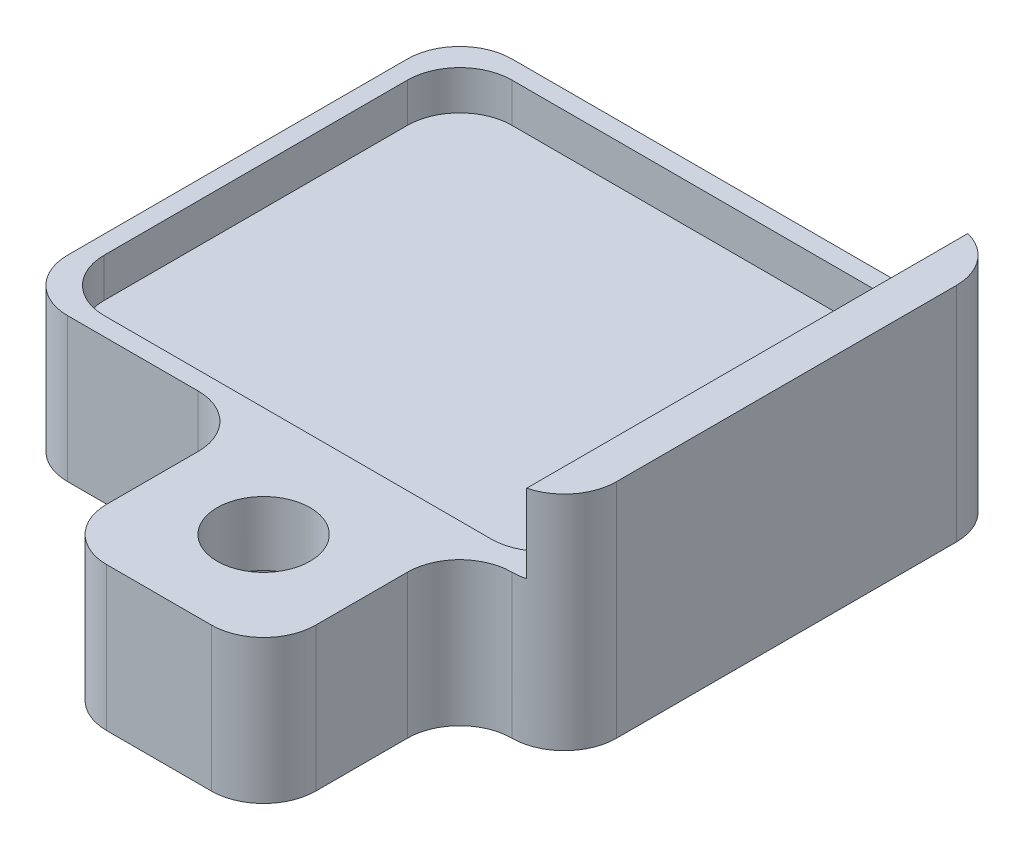
ISO-10303-21;
HEADER;
FILE_DESCRIPTION(('STEP AP214'),'2;1');
FILE_NAME('part.step','',(''),(''),'','','');
FILE_SCHEMA(('AUTOMOTIVE_DESIGN { 1 0 10303 214 1 1 1 1 }'));
ENDSEC;
DATA;
#1=APPLICATION_CONTEXT('core data for automotive mechanical design processes');
#2=APPLICATION_PROTOCOL_DEFINITION('international standard','automotive_design',2000,#1);
#3=PRODUCT_CONTEXT('',#1,'mechanical');
#4=PRODUCT('Part','Part','',(#3));
#5=PRODUCT_RELATED_PRODUCT_CATEGORY('part','',(#4));
#6=PRODUCT_DEFINITION_FORMATION('','',#4);
#7=PRODUCT_DEFINITION_CONTEXT('part definition',#1,'design');
#8=PRODUCT_DEFINITION('design','',#6,#7);
#9=PRODUCT_DEFINITION_SHAPE('','',#8);
#10=(LENGTH_UNIT() NAMED_UNIT(*) SI_UNIT(.MILLI.,.METRE.));
#11=(NAMED_UNIT(*) PLANE_ANGLE_UNIT() SI_UNIT($,.RADIAN.));
#12=(NAMED_UNIT(*) SI_UNIT($,.STERADIAN.) SOLID_ANGLE_UNIT());
#13=UNCERTAINTY_MEASURE_WITH_UNIT(LENGTH_MEASURE(1.E-05),#10,'distance_accuracy_value','');
#14=(GEOMETRIC_REPRESENTATION_CONTEXT(3) GLOBAL_UNCERTAINTY_ASSIGNED_CONTEXT((#13)) GLOBAL_UNIT_ASSIGNED_CONTEXT((#10,
#11,#12)) REPRESENTATION_CONTEXT('',''));
#15=CARTESIAN_POINT('',(0.,0.,0.));
#16=DIRECTION('',(0.,0.,1.));
#17=DIRECTION('',(1.,0.,0.));
#18=AXIS2_PLACEMENT_3D('',#15,#16,#17);
#19=CARTESIAN_POINT('',(-5.25,4.25,4.25));
#20=DIRECTION('',(0.,0.,-1.));
#21=DIRECTION('',(-1.,0.,0.));
#22=AXIS2_PLACEMENT_3D('',#19,#20,#21);
#23=PLANE('',#22);
#24=DIRECTION('',(1.,0.,0.));
#25=VECTOR('',#24,1.);
#26=CARTESIAN_POINT('',(-5.25,0.,4.25));
#27=LINE('',#26,#25);
#28=CARTESIAN_POINT('',(-4.25,0.,4.25));
#29=VERTEX_POINT('',#28);
#30=CARTESIAN_POINT('',(-1.75,0.,4.25));
#31=VERTEX_POINT('',#30);
#32=EDGE_CURVE('E369',#29,#31,#27,.T.);
#33=ORIENTED_EDGE('',*,*,#32,.T.);
#34=DIRECTION('',(0.,-1.,0.));
#35=VECTOR('',#34,1.);
#36=CARTESIAN_POINT('',(-1.75,2.75,4.25));
#37=LINE('',#36,#35);
#38=CARTESIAN_POINT('',(-1.75,2.75,4.25));
#39=VERTEX_POINT('',#38);
#40=EDGE_CURVE('E296',#31,#39,#37,.F.);
#41=ORIENTED_EDGE('',*,*,#40,.T.);
#42=DIRECTION('',(1.,0.,0.));
#43=VECTOR('',#42,1.);
#44=CARTESIAN_POINT('',(-5.25,2.75,4.25));
#45=LINE('',#44,#43);
#46=CARTESIAN_POINT('',(-4.25,2.75,4.25));
#47=VERTEX_POINT('',#46);
#48=EDGE_CURVE('E259',#47,#39,#45,.T.);
#49=ORIENTED_EDGE('',*,*,#48,.F.);
#50=DIRECTION('',(0.,-1.,0.));
#51=VECTOR('',#50,1.);
#52=CARTESIAN_POINT('',(-4.25,4.25,4.25));
#53=LINE('',#52,#51);
#54=EDGE_CURVE('E293',#47,#29,#53,.T.);
#55=ORIENTED_EDGE('',*,*,#54,.T.);
#56=EDGE_LOOP('',(#33,#41,#49,#55));
#57=FACE_BOUND('',#56,.T.);
#58=ADVANCED_FACE('F31',(#57),#23,.F.);
#59=CARTESIAN_POINT('',(-5.25,4.25,4.25));
#60=DIRECTION('',(1.,0.,0.));
#61=DIRECTION('',(0.,0.,-1.));
#62=AXIS2_PLACEMENT_3D('',#59,#60,#61);
#63=PLANE('',#62);
#64=DIRECTION('',(0.,0.,1.));
#65=VECTOR('',#64,1.);
#66=CARTESIAN_POINT('',(-5.25,2.75,-4.25));
#67=LINE('',#66,#65);
#68=CARTESIAN_POINT('',(-5.25,2.75,-3.25));
#69=VERTEX_POINT('',#68);
#70=CARTESIAN_POINT('',(-5.25,2.75,3.25));
#71=VERTEX_POINT('',#70);
#72=EDGE_CURVE('E353',#69,#71,#67,.T.);
#73=ORIENTED_EDGE('',*,*,#72,.F.);
#74=DIRECTION('',(0.,-1.,0.));
#75=VECTOR('',#74,1.);
#76=CARTESIAN_POINT('',(-5.25,4.25,-3.25));
#77=LINE('',#76,#75);
#78=CARTESIAN_POINT('',(-5.25,0.,-3.25));
#79=VERTEX_POINT('',#78);
#80=EDGE_CURVE('E290',#69,#79,#77,.T.);
#81=ORIENTED_EDGE('',*,*,#80,.T.);
#82=DIRECTION('',(0.,0.,1.));
#83=VECTOR('',#82,1.);
#84=CARTESIAN_POINT('',(-5.25,0.,4.25));
#85=LINE('',#84,#83);
#86=CARTESIAN_POINT('',(-5.25,0.,3.25));
#87=VERTEX_POINT('',#86);
#88=EDGE_CURVE('E374',#79,#87,#85,.T.);
#89=ORIENTED_EDGE('',*,*,#88,.T.);
#90=DIRECTION('',(0.,-1.,0.));
#91=VECTOR('',#90,1.);
#92=CARTESIAN_POINT('',(-5.25,4.25,3.25));
#93=LINE('',#92,#91);
#94=EDGE_CURVE('E288',#87,#71,#93,.F.);
#95=ORIENTED_EDGE('',*,*,#94,.T.);
#96=EDGE_LOOP('',(#73,#81,#89,#95));
#97=FACE_BOUND('',#96,.T.);
#98=ADVANCED_FACE('F476',(#97),#63,.F.);
#99=CARTESIAN_POINT('',(5.25,4.25,4.25));
#100=DIRECTION('',(-1.,0.,0.));
#101=DIRECTION('',(0.,0.,1.));
#102=AXIS2_PLACEMENT_3D('',#99,#100,#101);
#103=PLANE('',#102);
#104=DIRECTION('',(0.,0.,-1.));
#105=VECTOR('',#104,1.);
#106=CARTESIAN_POINT('',(5.25,0.,4.25));
#107=LINE('',#106,#105);
#108=CARTESIAN_POINT('',(5.25,0.,3.25));
#109=VERTEX_POINT('',#108);
#110=CARTESIAN_POINT('',(5.25,0.,-3.25));
#111=VERTEX_POINT('',#110);
#112=EDGE_CURVE('E222',#109,#111,#107,.T.);
#113=ORIENTED_EDGE('',*,*,#112,.T.);
#114=DIRECTION('',(0.,-1.,0.));
#115=VECTOR('',#114,1.);
#116=CARTESIAN_POINT('',(5.25,4.25,-3.25));
#117=LINE('',#116,#115);
#118=CARTESIAN_POINT('',(5.25,4.25,-3.25));
#119=VERTEX_POINT('',#118);
#120=EDGE_CURVE('E390',#111,#119,#117,.F.);
#121=ORIENTED_EDGE('',*,*,#120,.T.);
#122=DIRECTION('',(0.,0.,-1.));
#123=VECTOR('',#122,1.);
#124=CARTESIAN_POINT('',(5.25,4.25,4.25));
#125=LINE('',#124,#123);
#126=CARTESIAN_POINT('',(5.25,4.25,3.25));
#127=VERTEX_POINT('',#126);
#128=EDGE_CURVE('E233',#127,#119,#125,.T.);
#129=ORIENTED_EDGE('',*,*,#128,.F.);
#130=DIRECTION('',(0.,-1.,0.));
#131=VECTOR('',#130,1.);
#132=CARTESIAN_POINT('',(5.25,4.25,3.25));
#133=LINE('',#132,#131);
#134=EDGE_CURVE('E387',#127,#109,#133,.T.);
#135=ORIENTED_EDGE('',*,*,#134,.T.);
#136=EDGE_LOOP('',(#113,#121,#129,#135));
#137=FACE_BOUND('',#136,.T.);
#138=ADVANCED_FACE('F411',(#137),#103,.F.);
#139=CARTESIAN_POINT('',(-5.25,4.25,-4.25));
#140=DIRECTION('',(0.,0.,1.));
#141=DIRECTION('',(1.,0.,0.));
#142=AXIS2_PLACEMENT_3D('',#139,#140,#141);
#143=PLANE('',#142);
#144=DIRECTION('',(-1.,0.,0.));
#145=VECTOR('',#144,1.);
#146=CARTESIAN_POINT('',(-5.25,2.75,-4.25));
#147=LINE('',#146,#145);
#148=CARTESIAN_POINT('',(4.25,2.75,-4.25));
#149=VERTEX_POINT('',#148);
#150=CARTESIAN_POINT('',(-4.25,2.75,-4.25));
#151=VERTEX_POINT('',#150);
#152=EDGE_CURVE('E204',#149,#151,#147,.T.);
#153=ORIENTED_EDGE('',*,*,#152,.F.);
#154=DIRECTION('',(0.,-1.,0.));
#155=VECTOR('',#154,1.);
#156=CARTESIAN_POINT('',(4.25,4.25,-4.25));
#157=LINE('',#156,#155);
#158=CARTESIAN_POINT('',(4.25,0.,-4.25));
#159=VERTEX_POINT('',#158);
#160=EDGE_CURVE('E218',#149,#159,#157,.T.);
#161=ORIENTED_EDGE('',*,*,#160,.T.);
#162=DIRECTION('',(-1.,0.,0.));
#163=VECTOR('',#162,1.);
#164=CARTESIAN_POINT('',(-5.25,0.,-4.25));
#165=LINE('',#164,#163);
#166=CARTESIAN_POINT('',(-4.25,0.,-4.25));
#167=VERTEX_POINT('',#166);
#168=EDGE_CURVE('E372',#159,#167,#165,.T.);
#169=ORIENTED_EDGE('',*,*,#168,.T.);
#170=DIRECTION('',(0.,-1.,0.));
#171=VECTOR('',#170,1.);
#172=CARTESIAN_POINT('',(-4.25,4.25,-4.25));
#173=LINE('',#172,#171);
#174=EDGE_CURVE('E221',#167,#151,#173,.F.);
#175=ORIENTED_EDGE('',*,*,#174,.T.);
#176=EDGE_LOOP('',(#153,#161,#169,#175));
#177=FACE_BOUND('',#176,.T.);
#178=ADVANCED_FACE('F216',(#177),#143,.F.);
#179=CARTESIAN_POINT('',(5.25,4.25,-4.25));
#180=DIRECTION('',(0.,-1.,0.));
#181=DIRECTION('',(0.,0.,-1.));
#182=AXIS2_PLACEMENT_3D('',#179,#180,#181);
#183=PLANE('',#182);
#184=ORIENTED_EDGE('',*,*,#128,.T.);
#185=CARTESIAN_POINT('',(4.25,4.25,-3.25));
#186=DIRECTION('',(0.,-1.,0.));
#187=DIRECTION('',(0.,0.,-1.));
#188=AXIS2_PLACEMENT_3D('',#185,#186,#187);
#189=CIRCLE('',#188,1.);
#190=CARTESIAN_POINT('',(4.5,4.25,-4.21824583655185));
#191=VERTEX_POINT('',#190);
#192=EDGE_CURVE('E394',#119,#191,#189,.F.);
#193=ORIENTED_EDGE('',*,*,#192,.T.);
#194=DIRECTION('',(0.,0.,-1.));
#195=VECTOR('',#194,1.);
#196=CARTESIAN_POINT('',(4.5,4.25,-4.25));
#197=LINE('',#196,#195);
#198=CARTESIAN_POINT('',(4.5,4.25,4.21824583655185));
#199=VERTEX_POINT('',#198);
#200=EDGE_CURVE('E349',#199,#191,#197,.T.);
#201=ORIENTED_EDGE('',*,*,#200,.F.);
#202=CARTESIAN_POINT('',(4.25,4.25,3.25));
#203=DIRECTION('',(0.,-1.,0.));
#204=DIRECTION('',(0.,0.,-1.));
#205=AXIS2_PLACEMENT_3D('',#202,#203,#204);
#206=CIRCLE('',#205,1.);
#207=EDGE_CURVE('E392',#199,#127,#206,.F.);
#208=ORIENTED_EDGE('',*,*,#207,.T.);
#209=EDGE_LOOP('',(#184,#193,#201,#208));
#210=FACE_BOUND('',#209,.T.);
#211=ADVANCED_FACE('F406',(#210),#183,.F.);
#212=CARTESIAN_POINT('',(5.25,0.,-4.25));
#213=DIRECTION('',(0.,-1.,0.));
#214=DIRECTION('',(0.,0.,-1.));
#215=AXIS2_PLACEMENT_3D('',#212,#213,#214);
#216=PLANE('',#215);
#217=CARTESIAN_POINT('',(1.25,0.,6.));
#218=DIRECTION('',(0.,-1.,0.));
#219=DIRECTION('',(0.,0.,-1.));
#220=AXIS2_PLACEMENT_3D('',#217,#218,#219);
#221=CIRCLE('',#220,1.5875);
#222=CARTESIAN_POINT('',(1.25,0.,4.4125));
#223=VERTEX_POINT('',#222);
#224=EDGE_CURVE('E741',#223,#223,#221,.T.);
#225=ORIENTED_EDGE('',*,*,#224,.F.);
#226=EDGE_LOOP('',(#225));
#227=FACE_BOUND('',#226,.T.);
#228=ORIENTED_EDGE('',*,*,#168,.F.);
#229=CARTESIAN_POINT('',(4.25,0.,-3.25));
#230=DIRECTION('',(0.,-1.,0.));
#231=DIRECTION('',(0.,0.,-1.));
#232=AXIS2_PLACEMENT_3D('',#229,#230,#231);
#233=CIRCLE('',#232,1.);
#234=EDGE_CURVE('E228',#159,#111,#233,.T.);
#235=ORIENTED_EDGE('',*,*,#234,.T.);
#236=ORIENTED_EDGE('',*,*,#112,.F.);
#237=CARTESIAN_POINT('',(4.25,0.,3.25));
#238=DIRECTION('',(0.,-1.,0.));
#239=DIRECTION('',(0.,0.,-1.));
#240=AXIS2_PLACEMENT_3D('',#237,#238,#239);
#241=CIRCLE('',#240,1.);
#242=CARTESIAN_POINT('',(4.25,0.,4.25));
#243=VERTEX_POINT('',#242);
#244=EDGE_CURVE('E384',#109,#243,#241,.T.);
#245=ORIENTED_EDGE('',*,*,#244,.T.);
#246=CARTESIAN_POINT('',(4.25,0.,5.25));
#247=DIRECTION('',(0.,-1.,0.));
#248=DIRECTION('',(0.,0.,-1.));
#249=AXIS2_PLACEMENT_3D('',#246,#247,#248);
#250=CIRCLE('',#249,1.);
#251=CARTESIAN_POINT('',(3.25,0.,5.25));
#252=VERTEX_POINT('',#251);
#253=EDGE_CURVE('E321',#243,#252,#250,.F.);
#254=ORIENTED_EDGE('',*,*,#253,.T.);
#255=DIRECTION('',(0.,0.,-1.));
#256=VECTOR('',#255,1.);
#257=CARTESIAN_POINT('',(3.25,0.,8.));
#258=LINE('',#257,#256);
#259=CARTESIAN_POINT('',(3.25,0.,7.));
#260=VERTEX_POINT('',#259);
#261=EDGE_CURVE('E237',#260,#252,#258,.T.);
#262=ORIENTED_EDGE('',*,*,#261,.F.);
#263=CARTESIAN_POINT('',(2.25,0.,7.));
#264=DIRECTION('',(0.,-1.,0.));
#265=DIRECTION('',(0.,0.,-1.));
#266=AXIS2_PLACEMENT_3D('',#263,#264,#265);
#267=CIRCLE('',#266,1.);
#268=CARTESIAN_POINT('',(2.25,0.,8.));
#269=VERTEX_POINT('',#268);
#270=EDGE_CURVE('E382',#260,#269,#267,.T.);
#271=ORIENTED_EDGE('',*,*,#270,.T.);
#272=DIRECTION('',(1.,0.,0.));
#273=VECTOR('',#272,1.);
#274=CARTESIAN_POINT('',(-0.749999999999999,0.,8.));
#275=LINE('',#274,#273);
#276=CARTESIAN_POINT('',(0.250000000000001,0.,8.));
#277=VERTEX_POINT('',#276);
#278=EDGE_CURVE('E442',#277,#269,#275,.T.);
#279=ORIENTED_EDGE('',*,*,#278,.F.);
#280=CARTESIAN_POINT('',(0.250000000000001,0.,7.));
#281=DIRECTION('',(0.,-1.,0.));
#282=DIRECTION('',(0.,0.,-1.));
#283=AXIS2_PLACEMENT_3D('',#280,#281,#282);
#284=CIRCLE('',#283,1.);
#285=CARTESIAN_POINT('',(-0.749999999999999,0.,7.));
#286=VERTEX_POINT('',#285);
#287=EDGE_CURVE('E380',#277,#286,#284,.T.);
#288=ORIENTED_EDGE('',*,*,#287,.T.);
#289=DIRECTION('',(0.,0.,-1.));
#290=VECTOR('',#289,1.);
#291=CARTESIAN_POINT('',(-0.749999999999999,0.,8.));
#292=LINE('',#291,#290);
#293=CARTESIAN_POINT('',(-0.749999999999999,0.,5.25));
#294=VERTEX_POINT('',#293);
#295=EDGE_CURVE('E241',#286,#294,#292,.T.);
#296=ORIENTED_EDGE('',*,*,#295,.T.);
#297=CARTESIAN_POINT('',(-1.75,0.,5.25));
#298=DIRECTION('',(0.,-1.,0.));
#299=DIRECTION('',(0.,0.,-1.));
#300=AXIS2_PLACEMENT_3D('',#297,#298,#299);
#301=CIRCLE('',#300,1.);
#302=EDGE_CURVE('E323',#294,#31,#301,.F.);
#303=ORIENTED_EDGE('',*,*,#302,.T.);
#304=ORIENTED_EDGE('',*,*,#32,.F.);
#305=CARTESIAN_POINT('',(-4.25,0.,3.25));
#306=DIRECTION('',(0.,-1.,0.));
#307=DIRECTION('',(0.,0.,-1.));
#308=AXIS2_PLACEMENT_3D('',#305,#306,#307);
#309=CIRCLE('',#308,1.);
#310=EDGE_CURVE('E229',#29,#87,#309,.T.);
#311=ORIENTED_EDGE('',*,*,#310,.T.);
#312=ORIENTED_EDGE('',*,*,#88,.F.);
#313=CARTESIAN_POINT('',(-4.25,0.,-3.25));
#314=DIRECTION('',(0.,-1.,0.));
#315=DIRECTION('',(0.,0.,-1.));
#316=AXIS2_PLACEMENT_3D('',#313,#314,#315);
#317=CIRCLE('',#316,1.);
#318=EDGE_CURVE('E231',#79,#167,#317,.T.);
#319=ORIENTED_EDGE('',*,*,#318,.T.);
#320=EDGE_LOOP('',(#228,#235,#236,#245,#254,#262,#271,#279,#288,#296,#303,#304,#311,#312,#319));
#321=FACE_BOUND('',#320,.T.);
#322=ADVANCED_FACE('F421',(#227,#321),#216,.T.);
#323=CARTESIAN_POINT('',(4.5,2.75,-4.25));
#324=DIRECTION('',(1.,0.,0.));
#325=DIRECTION('',(0.,0.,-1.));
#326=AXIS2_PLACEMENT_3D('',#323,#324,#325);
#327=PLANE('',#326);
#328=ORIENTED_EDGE('',*,*,#200,.T.);
#329=DIRECTION('',(0.,-1.,0.));
#330=VECTOR('',#329,1.);
#331=CARTESIAN_POINT('',(4.5,4.25,-4.21824583655185));
#332=LINE('',#331,#330);
#333=CARTESIAN_POINT('',(4.5,2.75,-4.21824583655185));
#334=VERTEX_POINT('',#333);
#335=EDGE_CURVE('E267',#191,#334,#332,.T.);
#336=ORIENTED_EDGE('',*,*,#335,.T.);
#337=DIRECTION('',(0.,0.,-1.));
#338=VECTOR('',#337,1.);
#339=CARTESIAN_POINT('',(4.5,2.75,-4.25));
#340=LINE('',#339,#338);
#341=CARTESIAN_POINT('',(4.5,2.75,-2.9));
#342=VERTEX_POINT('',#341);
#343=EDGE_CURVE('E207',#342,#334,#340,.T.);
#344=ORIENTED_EDGE('',*,*,#343,.F.);
#345=DIRECTION('',(0.,1.,0.));
#346=VECTOR('',#345,1.);
#347=CARTESIAN_POINT('',(4.5,2.,-2.9));
#348=LINE('',#347,#346);
#349=CARTESIAN_POINT('',(4.5,2.,-2.9));
#350=VERTEX_POINT('',#349);
#351=EDGE_CURVE('E399',#342,#350,#348,.F.);
#352=ORIENTED_EDGE('',*,*,#351,.T.);
#353=DIRECTION('',(0.,0.,-1.));
#354=VECTOR('',#353,1.);
#355=CARTESIAN_POINT('',(4.5,2.,3.9));
#356=LINE('',#355,#354);
#357=CARTESIAN_POINT('',(4.5,2.,2.9));
#358=VERTEX_POINT('',#357);
#359=EDGE_CURVE('E362',#358,#350,#356,.T.);
#360=ORIENTED_EDGE('',*,*,#359,.F.);
#361=DIRECTION('',(0.,1.,0.));
#362=VECTOR('',#361,1.);
#363=CARTESIAN_POINT('',(4.5,2.75,2.9));
#364=LINE('',#363,#362);
#365=CARTESIAN_POINT('',(4.5,2.75,2.9));
#366=VERTEX_POINT('',#365);
#367=EDGE_CURVE('E396',#358,#366,#364,.T.);
#368=ORIENTED_EDGE('',*,*,#367,.T.);
#369=CARTESIAN_POINT('',(4.5,2.75,4.21824583655185));
#370=VERTEX_POINT('',#369);
#371=EDGE_CURVE('E223',#370,#366,#340,.T.);
#372=ORIENTED_EDGE('',*,*,#371,.F.);
#373=DIRECTION('',(0.,-1.,0.));
#374=VECTOR('',#373,1.);
#375=CARTESIAN_POINT('',(4.5,2.75,4.21824583655185));
#376=LINE('',#375,#374);
#377=EDGE_CURVE('E401',#370,#199,#376,.F.);
#378=ORIENTED_EDGE('',*,*,#377,.T.);
#379=EDGE_LOOP('',(#328,#336,#344,#352,#360,#368,#372,#378));
#380=FACE_BOUND('',#379,.T.);
#381=ADVANCED_FACE('F403',(#380),#327,.F.);
#382=CARTESIAN_POINT('',(-5.25,2.75,4.25));
#383=DIRECTION('',(0.,1.,0.));
#384=DIRECTION('',(0.,0.,1.));
#385=AXIS2_PLACEMENT_3D('',#382,#383,#384);
#386=PLANE('',#385);
#387=CARTESIAN_POINT('',(1.25,2.75,6.));
#388=DIRECTION('',(0.,1.,0.));
#389=DIRECTION('',(0.,0.,1.));
#390=AXIS2_PLACEMENT_3D('',#387,#388,#389);
#391=CIRCLE('',#390,0.888999999999999);
#392=CARTESIAN_POINT('',(1.25,2.75,6.889));
#393=VERTEX_POINT('',#392);
#394=EDGE_CURVE('E252',#393,#393,#391,.T.);
#395=ORIENTED_EDGE('',*,*,#394,.F.);
#396=EDGE_LOOP('',(#395));
#397=FACE_BOUND('',#396,.T.);
#398=ORIENTED_EDGE('',*,*,#343,.T.);
#399=CARTESIAN_POINT('',(4.25,2.75,-3.25));
#400=DIRECTION('',(0.,1.,0.));
#401=DIRECTION('',(0.,0.,1.));
#402=AXIS2_PLACEMENT_3D('',#399,#400,#401);
#403=CIRCLE('',#402,1.);
#404=EDGE_CURVE('E201',#334,#149,#403,.T.);
#405=ORIENTED_EDGE('',*,*,#404,.T.);
#406=ORIENTED_EDGE('',*,*,#152,.T.);
#407=CARTESIAN_POINT('',(-4.25,2.75,-3.25));
#408=DIRECTION('',(0.,1.,0.));
#409=DIRECTION('',(0.,0.,1.));
#410=AXIS2_PLACEMENT_3D('',#407,#408,#409);
#411=CIRCLE('',#410,1.);
#412=EDGE_CURVE('E266',#151,#69,#411,.T.);
#413=ORIENTED_EDGE('',*,*,#412,.T.);
#414=ORIENTED_EDGE('',*,*,#72,.T.);
#415=CARTESIAN_POINT('',(-4.25,2.75,3.25));
#416=DIRECTION('',(0.,1.,0.));
#417=DIRECTION('',(0.,0.,1.));
#418=AXIS2_PLACEMENT_3D('',#415,#416,#417);
#419=CIRCLE('',#418,1.);
#420=EDGE_CURVE('E264',#71,#47,#419,.T.);
#421=ORIENTED_EDGE('',*,*,#420,.T.);
#422=ORIENTED_EDGE('',*,*,#48,.T.);
#423=CARTESIAN_POINT('',(-1.75,2.75,5.25));
#424=DIRECTION('',(0.,1.,0.));
#425=DIRECTION('',(0.,0.,1.));
#426=AXIS2_PLACEMENT_3D('',#423,#424,#425);
#427=CIRCLE('',#426,1.);
#428=CARTESIAN_POINT('',(-0.749999999999999,2.75,5.25));
#429=VERTEX_POINT('',#428);
#430=EDGE_CURVE('E325',#39,#429,#427,.F.);
#431=ORIENTED_EDGE('',*,*,#430,.T.);
#432=DIRECTION('',(0.,0.,-1.));
#433=VECTOR('',#432,1.);
#434=CARTESIAN_POINT('',(-0.749999999999999,2.75,8.));
#435=LINE('',#434,#433);
#436=CARTESIAN_POINT('',(-0.749999999999999,2.75,7.));
#437=VERTEX_POINT('',#436);
#438=EDGE_CURVE('E254',#437,#429,#435,.T.);
#439=ORIENTED_EDGE('',*,*,#438,.F.);
#440=CARTESIAN_POINT('',(0.250000000000001,2.75,7.));
#441=DIRECTION('',(0.,1.,0.));
#442=DIRECTION('',(0.,0.,1.));
#443=AXIS2_PLACEMENT_3D('',#440,#441,#442);
#444=CIRCLE('',#443,1.);
#445=CARTESIAN_POINT('',(0.250000000000001,2.75,8.));
#446=VERTEX_POINT('',#445);
#447=EDGE_CURVE('E269',#437,#446,#444,.T.);
#448=ORIENTED_EDGE('',*,*,#447,.T.);
#449=DIRECTION('',(-1.,0.,0.));
#450=VECTOR('',#449,1.);
#451=CARTESIAN_POINT('',(-0.749999999999999,2.75,8.));
#452=LINE('',#451,#450);
#453=CARTESIAN_POINT('',(2.25,2.75,8.));
#454=VERTEX_POINT('',#453);
#455=EDGE_CURVE('E258',#454,#446,#452,.T.);
#456=ORIENTED_EDGE('',*,*,#455,.F.);
#457=CARTESIAN_POINT('',(2.25,2.75,7.));
#458=DIRECTION('',(0.,1.,0.));
#459=DIRECTION('',(0.,0.,1.));
#460=AXIS2_PLACEMENT_3D('',#457,#458,#459);
#461=CIRCLE('',#460,1.);
#462=CARTESIAN_POINT('',(3.25,2.75,7.));
#463=VERTEX_POINT('',#462);
#464=EDGE_CURVE('E271',#454,#463,#461,.T.);
#465=ORIENTED_EDGE('',*,*,#464,.T.);
#466=DIRECTION('',(0.,0.,-1.));
#467=VECTOR('',#466,1.);
#468=CARTESIAN_POINT('',(3.25,2.75,8.));
#469=LINE('',#468,#467);
#470=CARTESIAN_POINT('',(3.25,2.75,5.25));
#471=VERTEX_POINT('',#470);
#472=EDGE_CURVE('E242',#463,#471,#469,.T.);
#473=ORIENTED_EDGE('',*,*,#472,.T.);
#474=CARTESIAN_POINT('',(4.25,2.75,5.25));
#475=DIRECTION('',(0.,1.,0.));
#476=DIRECTION('',(0.,0.,1.));
#477=AXIS2_PLACEMENT_3D('',#474,#475,#476);
#478=CIRCLE('',#477,1.);
#479=CARTESIAN_POINT('',(4.25,2.75,4.25));
#480=VERTEX_POINT('',#479);
#481=EDGE_CURVE('E319',#471,#480,#478,.F.);
#482=ORIENTED_EDGE('',*,*,#481,.T.);
#483=CARTESIAN_POINT('',(4.25,2.75,3.25));
#484=DIRECTION('',(0.,1.,0.));
#485=DIRECTION('',(0.,0.,1.));
#486=AXIS2_PLACEMENT_3D('',#483,#484,#485);
#487=CIRCLE('',#486,1.);
#488=EDGE_CURVE('E212',#480,#370,#487,.T.);
#489=ORIENTED_EDGE('',*,*,#488,.T.);
#490=ORIENTED_EDGE('',*,*,#371,.T.);
#491=CARTESIAN_POINT('',(3.5,2.75,2.9));
#492=DIRECTION('',(0.,1.,0.));
#493=DIRECTION('',(0.,0.,1.));
#494=AXIS2_PLACEMENT_3D('',#491,#492,#493);
#495=CIRCLE('',#494,1.);
#496=CARTESIAN_POINT('',(3.5,2.75,3.9));
#497=VERTEX_POINT('',#496);
#498=EDGE_CURVE('E11',#366,#497,#495,.F.);
#499=ORIENTED_EDGE('',*,*,#498,.T.);
#500=DIRECTION('',(1.,0.,0.));
#501=VECTOR('',#500,1.);
#502=CARTESIAN_POINT('',(-4.9,2.75,3.9));
#503=LINE('',#502,#501);
#504=CARTESIAN_POINT('',(-3.9,2.75,3.9));
#505=VERTEX_POINT('',#504);
#506=EDGE_CURVE('E335',#505,#497,#503,.T.);
#507=ORIENTED_EDGE('',*,*,#506,.F.);
#508=CARTESIAN_POINT('',(-3.9,2.75,2.9));
#509=DIRECTION('',(0.,1.,0.));
#510=DIRECTION('',(0.,0.,1.));
#511=AXIS2_PLACEMENT_3D('',#508,#509,#510);
#512=CIRCLE('',#511,1.);
#513=CARTESIAN_POINT('',(-4.9,2.75,2.9));
#514=VERTEX_POINT('',#513);
#515=EDGE_CURVE('E40',#505,#514,#512,.F.);
#516=ORIENTED_EDGE('',*,*,#515,.T.);
#517=DIRECTION('',(0.,0.,1.));
#518=VECTOR('',#517,1.);
#519=CARTESIAN_POINT('',(-4.9,2.75,3.9));
#520=LINE('',#519,#518);
#521=CARTESIAN_POINT('',(-4.9,2.75,-2.9));
#522=VERTEX_POINT('',#521);
#523=EDGE_CURVE('E334',#522,#514,#520,.T.);
#524=ORIENTED_EDGE('',*,*,#523,.F.);
#525=CARTESIAN_POINT('',(-3.9,2.75,-2.9));
#526=DIRECTION('',(0.,1.,0.));
#527=DIRECTION('',(0.,0.,1.));
#528=AXIS2_PLACEMENT_3D('',#525,#526,#527);
#529=CIRCLE('',#528,1.);
#530=CARTESIAN_POINT('',(-3.9,2.75,-3.9));
#531=VERTEX_POINT('',#530);
#532=EDGE_CURVE('E329',#522,#531,#529,.F.);
#533=ORIENTED_EDGE('',*,*,#532,.T.);
#534=DIRECTION('',(-1.,0.,0.));
#535=VECTOR('',#534,1.);
#536=CARTESIAN_POINT('',(-4.9,2.75,-3.9));
#537=LINE('',#536,#535);
#538=CARTESIAN_POINT('',(3.5,2.75,-3.9));
#539=VERTEX_POINT('',#538);
#540=EDGE_CURVE('E343',#539,#531,#537,.T.);
#541=ORIENTED_EDGE('',*,*,#540,.F.);
#542=CARTESIAN_POINT('',(3.5,2.75,-2.9));
#543=DIRECTION('',(0.,1.,0.));
#544=DIRECTION('',(0.,0.,1.));
#545=AXIS2_PLACEMENT_3D('',#542,#543,#544);
#546=CIRCLE('',#545,1.);
#547=EDGE_CURVE('E327',#539,#342,#546,.F.);
#548=ORIENTED_EDGE('',*,*,#547,.T.);
#549=EDGE_LOOP('',(#398,#405,#406,#413,#414,#421,#422,#431,#439,#448,#456,#465,#473,#482,#489,
#490,#499,#507,#516,#524,#533,#541,#548));
#550=FACE_BOUND('',#549,.T.);
#551=ADVANCED_FACE('F203',(#397,#550),#386,.T.);
#552=CARTESIAN_POINT('',(-4.9,2.,3.9));
#553=DIRECTION('',(0.,0.,1.));
#554=DIRECTION('',(1.,0.,0.));
#555=AXIS2_PLACEMENT_3D('',#552,#553,#554);
#556=PLANE('',#555);
#557=DIRECTION('',(1.,0.,0.));
#558=VECTOR('',#557,1.);
#559=CARTESIAN_POINT('',(-4.9,2.,3.9));
#560=LINE('',#559,#558);
#561=CARTESIAN_POINT('',(-3.9,2.,3.9));
#562=VERTEX_POINT('',#561);
#563=CARTESIAN_POINT('',(3.5,2.,3.9));
#564=VERTEX_POINT('',#563);
#565=EDGE_CURVE('E347',#562,#564,#560,.T.);
#566=ORIENTED_EDGE('',*,*,#565,.F.);
#567=DIRECTION('',(0.,1.,0.));
#568=VECTOR('',#567,1.);
#569=CARTESIAN_POINT('',(-3.9,2.75,3.9));
#570=LINE('',#569,#568);
#571=EDGE_CURVE('E316',#562,#505,#570,.T.);
#572=ORIENTED_EDGE('',*,*,#571,.T.);
#573=ORIENTED_EDGE('',*,*,#506,.T.);
#574=DIRECTION('',(0.,1.,0.));
#575=VECTOR('',#574,1.);
#576=CARTESIAN_POINT('',(3.5,2.,3.9));
#577=LINE('',#576,#575);
#578=EDGE_CURVE('E47',#497,#564,#577,.F.);
#579=ORIENTED_EDGE('',*,*,#578,.T.);
#580=EDGE_LOOP('',(#566,#572,#573,#579));
#581=FACE_BOUND('',#580,.T.);
#582=ADVANCED_FACE('F346',(#581),#556,.F.);
#583=CARTESIAN_POINT('',(-4.9,2.,3.9));
#584=DIRECTION('',(-1.,0.,0.));
#585=DIRECTION('',(0.,0.,1.));
#586=AXIS2_PLACEMENT_3D('',#583,#584,#585);
#587=PLANE('',#586);
#588=DIRECTION('',(0.,0.,1.));
#589=VECTOR('',#588,1.);
#590=CARTESIAN_POINT('',(-4.9,2.,3.9));
#591=LINE('',#590,#589);
#592=CARTESIAN_POINT('',(-4.9,2.,-2.9));
#593=VERTEX_POINT('',#592);
#594=CARTESIAN_POINT('',(-4.9,2.,2.9));
#595=VERTEX_POINT('',#594);
#596=EDGE_CURVE('E350',#593,#595,#591,.T.);
#597=ORIENTED_EDGE('',*,*,#596,.F.);
#598=DIRECTION('',(0.,1.,0.));
#599=VECTOR('',#598,1.);
#600=CARTESIAN_POINT('',(-4.9,2.75,-2.9));
#601=LINE('',#600,#599);
#602=EDGE_CURVE('E312',#593,#522,#601,.T.);
#603=ORIENTED_EDGE('',*,*,#602,.T.);
#604=ORIENTED_EDGE('',*,*,#523,.T.);
#605=DIRECTION('',(0.,1.,0.));
#606=VECTOR('',#605,1.);
#607=CARTESIAN_POINT('',(-4.9,2.,2.9));
#608=LINE('',#607,#606);
#609=EDGE_CURVE('E310',#514,#595,#608,.F.);
#610=ORIENTED_EDGE('',*,*,#609,.T.);
#611=EDGE_LOOP('',(#597,#603,#604,#610));
#612=FACE_BOUND('',#611,.T.);
#613=ADVANCED_FACE('F341',(#612),#587,.F.);
#614=CARTESIAN_POINT('',(-4.9,2.,-3.9));
#615=DIRECTION('',(0.,0.,-1.));
#616=DIRECTION('',(-1.,0.,0.));
#617=AXIS2_PLACEMENT_3D('',#614,#615,#616);
#618=PLANE('',#617);
#619=DIRECTION('',(-1.,0.,0.));
#620=VECTOR('',#619,1.);
#621=CARTESIAN_POINT('',(-4.9,2.,-3.9));
#622=LINE('',#621,#620);
#623=CARTESIAN_POINT('',(3.5,2.,-3.9));
#624=VERTEX_POINT('',#623);
#625=CARTESIAN_POINT('',(-3.9,2.,-3.9));
#626=VERTEX_POINT('',#625);
#627=EDGE_CURVE('E355',#624,#626,#622,.T.);
#628=ORIENTED_EDGE('',*,*,#627,.F.);
#629=DIRECTION('',(0.,1.,0.));
#630=VECTOR('',#629,1.);
#631=CARTESIAN_POINT('',(3.5,2.75,-3.9));
#632=LINE('',#631,#630);
#633=EDGE_CURVE('E300',#624,#539,#632,.T.);
#634=ORIENTED_EDGE('',*,*,#633,.T.);
#635=ORIENTED_EDGE('',*,*,#540,.T.);
#636=DIRECTION('',(0.,1.,0.));
#637=VECTOR('',#636,1.);
#638=CARTESIAN_POINT('',(-3.9,2.,-3.9));
#639=LINE('',#638,#637);
#640=EDGE_CURVE('E298',#531,#626,#639,.F.);
#641=ORIENTED_EDGE('',*,*,#640,.T.);
#642=EDGE_LOOP('',(#628,#634,#635,#641));
#643=FACE_BOUND('',#642,.T.);
#644=ADVANCED_FACE('F462',(#643),#618,.F.);
#645=CARTESIAN_POINT('',(4.5,2.,-3.9));
#646=DIRECTION('',(0.,-1.,0.));
#647=DIRECTION('',(0.,0.,-1.));
#648=AXIS2_PLACEMENT_3D('',#645,#646,#647);
#649=PLANE('',#648);
#650=ORIENTED_EDGE('',*,*,#359,.T.);
#651=CARTESIAN_POINT('',(3.5,2.,-2.9));
#652=DIRECTION('',(0.,-1.,0.));
#653=DIRECTION('',(0.,0.,-1.));
#654=AXIS2_PLACEMENT_3D('',#651,#652,#653);
#655=CIRCLE('',#654,1.);
#656=EDGE_CURVE('E308',#350,#624,#655,.F.);
#657=ORIENTED_EDGE('',*,*,#656,.T.);
#658=ORIENTED_EDGE('',*,*,#627,.T.);
#659=CARTESIAN_POINT('',(-3.9,2.,-2.9));
#660=DIRECTION('',(0.,-1.,0.));
#661=DIRECTION('',(0.,0.,-1.));
#662=AXIS2_PLACEMENT_3D('',#659,#660,#661);
#663=CIRCLE('',#662,1.);
#664=EDGE_CURVE('E306',#626,#593,#663,.F.);
#665=ORIENTED_EDGE('',*,*,#664,.T.);
#666=ORIENTED_EDGE('',*,*,#596,.T.);
#667=CARTESIAN_POINT('',(-3.9,2.,2.9));
#668=DIRECTION('',(0.,-1.,0.));
#669=DIRECTION('',(0.,0.,-1.));
#670=AXIS2_PLACEMENT_3D('',#667,#668,#669);
#671=CIRCLE('',#670,1.);
#672=EDGE_CURVE('E54',#595,#562,#671,.F.);
#673=ORIENTED_EDGE('',*,*,#672,.T.);
#674=ORIENTED_EDGE('',*,*,#565,.T.);
#675=CARTESIAN_POINT('',(3.5,2.,2.9));
#676=DIRECTION('',(0.,-1.,0.));
#677=DIRECTION('',(0.,0.,-1.));
#678=AXIS2_PLACEMENT_3D('',#675,#676,#677);
#679=CIRCLE('',#678,1.);
#680=EDGE_CURVE('E303',#564,#358,#679,.F.);
#681=ORIENTED_EDGE('',*,*,#680,.T.);
#682=EDGE_LOOP('',(#650,#657,#658,#665,#666,#673,#674,#681));
#683=FACE_BOUND('',#682,.T.);
#684=ADVANCED_FACE('F454',(#683),#649,.F.);
#685=CARTESIAN_POINT('',(-0.749999999999999,2.75,8.));
#686=DIRECTION('',(1.,0.,0.));
#687=DIRECTION('',(0.,1.,0.));
#688=AXIS2_PLACEMENT_3D('',#685,#686,#687);
#689=PLANE('',#688);
#690=ORIENTED_EDGE('',*,*,#295,.F.);
#691=DIRECTION('',(0.,-1.,0.));
#692=VECTOR('',#691,1.);
#693=CARTESIAN_POINT('',(-0.749999999999999,2.75,7.));
#694=LINE('',#693,#692);
#695=EDGE_CURVE('E286',#286,#437,#694,.F.);
#696=ORIENTED_EDGE('',*,*,#695,.T.);
#697=ORIENTED_EDGE('',*,*,#438,.T.);
#698=DIRECTION('',(0.,-1.,0.));
#699=VECTOR('',#698,1.);
#700=CARTESIAN_POINT('',(-0.749999999999999,0.,5.25));
#701=LINE('',#700,#699);
#702=EDGE_CURVE('E283',#429,#294,#701,.T.);
#703=ORIENTED_EDGE('',*,*,#702,.T.);
#704=EDGE_LOOP('',(#690,#696,#697,#703));
#705=FACE_BOUND('',#704,.T.);
#706=ADVANCED_FACE('F620',(#705),#689,.F.);
#707=CARTESIAN_POINT('',(3.25,2.75,8.));
#708=DIRECTION('',(-1.,0.,0.));
#709=DIRECTION('',(0.,-1.,0.));
#710=AXIS2_PLACEMENT_3D('',#707,#708,#709);
#711=PLANE('',#710);
#712=ORIENTED_EDGE('',*,*,#261,.T.);
#713=DIRECTION('',(0.,1.,0.));
#714=VECTOR('',#713,1.);
#715=CARTESIAN_POINT('',(3.25,2.75,5.25));
#716=LINE('',#715,#714);
#717=EDGE_CURVE('E275',#252,#471,#716,.T.);
#718=ORIENTED_EDGE('',*,*,#717,.T.);
#719=ORIENTED_EDGE('',*,*,#472,.F.);
#720=DIRECTION('',(0.,1.,0.));
#721=VECTOR('',#720,1.);
#722=CARTESIAN_POINT('',(3.25,0.,7.));
#723=LINE('',#722,#721);
#724=EDGE_CURVE('E211',#463,#260,#723,.F.);
#725=ORIENTED_EDGE('',*,*,#724,.T.);
#726=EDGE_LOOP('',(#712,#718,#719,#725));
#727=FACE_BOUND('',#726,.T.);
#728=ADVANCED_FACE('F429',(#727),#711,.F.);
#729=CARTESIAN_POINT('',(-0.749999999999999,0.,8.));
#730=DIRECTION('',(0.,0.,1.));
#731=DIRECTION('',(1.,0.,0.));
#732=AXIS2_PLACEMENT_3D('',#729,#730,#731);
#733=PLANE('',#732);
#734=ORIENTED_EDGE('',*,*,#278,.T.);
#735=DIRECTION('',(0.,1.,0.));
#736=VECTOR('',#735,1.);
#737=CARTESIAN_POINT('',(2.25,2.75,8.));
#738=LINE('',#737,#736);
#739=EDGE_CURVE('E280',#269,#454,#738,.T.);
#740=ORIENTED_EDGE('',*,*,#739,.T.);
#741=ORIENTED_EDGE('',*,*,#455,.T.);
#742=DIRECTION('',(0.,-1.,0.));
#743=VECTOR('',#742,1.);
#744=CARTESIAN_POINT('',(0.250000000000001,0.,8.));
#745=LINE('',#744,#743);
#746=EDGE_CURVE('E277',#446,#277,#745,.T.);
#747=ORIENTED_EDGE('',*,*,#746,.T.);
#748=EDGE_LOOP('',(#734,#740,#741,#747));
#749=FACE_BOUND('',#748,.T.);
#750=ADVANCED_FACE('F439',(#749),#733,.T.);
#751=CARTESIAN_POINT('',(1.25,0.,6.));
#752=DIRECTION('',(0.,-1.,0.));
#753=DIRECTION('',(0.,0.,-1.));
#754=AXIS2_PLACEMENT_3D('',#751,#752,#753);
#755=CYLINDRICAL_SURFACE('',#754,0.888999999999999);
#756=ORIENTED_EDGE('',*,*,#394,.T.);
#757=EDGE_LOOP('',(#756));
#758=FACE_BOUND('',#757,.T.);
#759=CARTESIAN_POINT('',(1.25,1.524,6.));
#760=DIRECTION('',(0.,-1.,0.));
#761=DIRECTION('',(0.,0.,-1.));
#762=AXIS2_PLACEMENT_3D('',#759,#760,#761);
#763=CIRCLE('',#762,0.889);
#764=CARTESIAN_POINT('',(1.25,1.524,5.111));
#765=VERTEX_POINT('',#764);
#766=EDGE_CURVE('E446',#765,#765,#763,.T.);
#767=ORIENTED_EDGE('',*,*,#766,.T.);
#768=EDGE_LOOP('',(#767));
#769=FACE_BOUND('',#768,.T.);
#770=ADVANCED_FACE('F597',(#758,#769),#755,.F.);
#771=CARTESIAN_POINT('',(2.139,1.524,6.));
#772=DIRECTION('',(0.,1.,0.));
#773=DIRECTION('',(0.,0.,1.));
#774=AXIS2_PLACEMENT_3D('',#771,#772,#773);
#775=PLANE('',#774);
#776=ORIENTED_EDGE('',*,*,#766,.F.);
#777=EDGE_LOOP('',(#776));
#778=FACE_BOUND('',#777,.T.);
#779=CARTESIAN_POINT('',(1.25,1.524,6.));
#780=DIRECTION('',(0.,-1.,0.));
#781=DIRECTION('',(0.,0.,-1.));
#782=AXIS2_PLACEMENT_3D('',#779,#780,#781);
#783=CIRCLE('',#782,1.5875);
#784=CARTESIAN_POINT('',(1.25,1.524,4.4125));
#785=VERTEX_POINT('',#784);
#786=EDGE_CURVE('E743',#785,#785,#783,.T.);
#787=ORIENTED_EDGE('',*,*,#786,.T.);
#788=EDGE_LOOP('',(#787));
#789=FACE_BOUND('',#788,.T.);
#790=ADVANCED_FACE('F588',(#778,#789),#775,.F.);
#791=CARTESIAN_POINT('',(1.25,0.,6.));
#792=DIRECTION('',(0.,-1.,0.));
#793=DIRECTION('',(0.,0.,-1.));
#794=AXIS2_PLACEMENT_3D('',#791,#792,#793);
#795=CYLINDRICAL_SURFACE('',#794,1.5875);
#796=ORIENTED_EDGE('',*,*,#786,.F.);
#797=EDGE_LOOP('',(#796));
#798=FACE_BOUND('',#797,.T.);
#799=ORIENTED_EDGE('',*,*,#224,.T.);
#800=EDGE_LOOP('',(#799));
#801=FACE_BOUND('',#800,.T.);
#802=ADVANCED_FACE('F493',(#798,#801),#795,.F.);
#803=CARTESIAN_POINT('',(4.25,4.25,-3.25));
#804=DIRECTION('',(0.,-1.,0.));
#805=DIRECTION('',(0.,0.,-1.));
#806=AXIS2_PLACEMENT_3D('',#803,#804,#805);
#807=CYLINDRICAL_SURFACE('',#806,1.);
#808=ORIENTED_EDGE('',*,*,#192,.F.);
#809=ORIENTED_EDGE('',*,*,#120,.F.);
#810=ORIENTED_EDGE('',*,*,#234,.F.);
#811=ORIENTED_EDGE('',*,*,#160,.F.);
#812=ORIENTED_EDGE('',*,*,#404,.F.);
#813=ORIENTED_EDGE('',*,*,#335,.F.);
#814=EDGE_LOOP('',(#808,#809,#810,#811,#812,#813));
#815=FACE_BOUND('',#814,.T.);
#816=ADVANCED_FACE('F226',(#815),#807,.T.);
#817=CARTESIAN_POINT('',(4.25,2.75,5.25));
#818=DIRECTION('',(0.,-1.,0.));
#819=DIRECTION('',(1.,0.,0.));
#820=AXIS2_PLACEMENT_3D('',#817,#818,#819);
#821=CYLINDRICAL_SURFACE('',#820,1.);
#822=DIRECTION('',(0.,1.,0.));
#823=VECTOR('',#822,1.);
#824=CARTESIAN_POINT('',(4.25,0.,4.25));
#825=LINE('',#824,#823);
#826=EDGE_CURVE('E35',#480,#243,#825,.F.);
#827=ORIENTED_EDGE('',*,*,#826,.F.);
#828=ORIENTED_EDGE('',*,*,#481,.F.);
#829=ORIENTED_EDGE('',*,*,#717,.F.);
#830=ORIENTED_EDGE('',*,*,#253,.F.);
#831=EDGE_LOOP('',(#827,#828,#829,#830));
#832=FACE_BOUND('',#831,.T.);
#833=ADVANCED_FACE('F425',(#832),#821,.F.);
#834=CARTESIAN_POINT('',(4.25,4.25,3.25));
#835=DIRECTION('',(0.,-1.,0.));
#836=DIRECTION('',(0.,0.,-1.));
#837=AXIS2_PLACEMENT_3D('',#834,#835,#836);
#838=CYLINDRICAL_SURFACE('',#837,1.);
#839=ORIENTED_EDGE('',*,*,#488,.F.);
#840=ORIENTED_EDGE('',*,*,#826,.T.);
#841=ORIENTED_EDGE('',*,*,#244,.F.);
#842=ORIENTED_EDGE('',*,*,#134,.F.);
#843=ORIENTED_EDGE('',*,*,#207,.F.);
#844=ORIENTED_EDGE('',*,*,#377,.F.);
#845=EDGE_LOOP('',(#839,#840,#841,#842,#843,#844));
#846=FACE_BOUND('',#845,.T.);
#847=ADVANCED_FACE('F415',(#846),#838,.T.);
#848=CARTESIAN_POINT('',(2.25,0.,7.));
#849=DIRECTION('',(0.,-1.,0.));
#850=DIRECTION('',(1.,0.,0.));
#851=AXIS2_PLACEMENT_3D('',#848,#849,#850);
#852=CYLINDRICAL_SURFACE('',#851,1.);
#853=ORIENTED_EDGE('',*,*,#270,.F.);
#854=ORIENTED_EDGE('',*,*,#724,.F.);
#855=ORIENTED_EDGE('',*,*,#464,.F.);
#856=ORIENTED_EDGE('',*,*,#739,.F.);
#857=EDGE_LOOP('',(#853,#854,#855,#856));
#858=FACE_BOUND('',#857,.T.);
#859=ADVANCED_FACE('F436',(#858),#852,.T.);
#860=CARTESIAN_POINT('',(0.250000000000001,0.,7.));
#861=DIRECTION('',(0.,1.,0.));
#862=DIRECTION('',(-1.,0.,0.));
#863=AXIS2_PLACEMENT_3D('',#860,#861,#862);
#864=CYLINDRICAL_SURFACE('',#863,1.);
#865=ORIENTED_EDGE('',*,*,#447,.F.);
#866=ORIENTED_EDGE('',*,*,#695,.F.);
#867=ORIENTED_EDGE('',*,*,#287,.F.);
#868=ORIENTED_EDGE('',*,*,#746,.F.);
#869=EDGE_LOOP('',(#865,#866,#867,#868));
#870=FACE_BOUND('',#869,.T.);
#871=ADVANCED_FACE('F500',(#870),#864,.T.);
#872=CARTESIAN_POINT('',(-4.25,4.25,-3.25));
#873=DIRECTION('',(0.,-1.,0.));
#874=DIRECTION('',(0.,0.,-1.));
#875=AXIS2_PLACEMENT_3D('',#872,#873,#874);
#876=CYLINDRICAL_SURFACE('',#875,1.);
#877=ORIENTED_EDGE('',*,*,#412,.F.);
#878=ORIENTED_EDGE('',*,*,#174,.F.);
#879=ORIENTED_EDGE('',*,*,#318,.F.);
#880=ORIENTED_EDGE('',*,*,#80,.F.);
#881=EDGE_LOOP('',(#877,#878,#879,#880));
#882=FACE_BOUND('',#881,.T.);
#883=ADVANCED_FACE('F503',(#882),#876,.T.);
#884=CARTESIAN_POINT('',(-1.75,2.75,5.25));
#885=DIRECTION('',(0.,1.,0.));
#886=DIRECTION('',(-1.,0.,0.));
#887=AXIS2_PLACEMENT_3D('',#884,#885,#886);
#888=CYLINDRICAL_SURFACE('',#887,1.);
#889=ORIENTED_EDGE('',*,*,#430,.F.);
#890=ORIENTED_EDGE('',*,*,#40,.F.);
#891=ORIENTED_EDGE('',*,*,#302,.F.);
#892=ORIENTED_EDGE('',*,*,#702,.F.);
#893=EDGE_LOOP('',(#889,#890,#891,#892));
#894=FACE_BOUND('',#893,.T.);
#895=ADVANCED_FACE('F507',(#894),#888,.F.);
#896=CARTESIAN_POINT('',(-4.25,4.25,3.25));
#897=DIRECTION('',(0.,-1.,0.));
#898=DIRECTION('',(0.,0.,-1.));
#899=AXIS2_PLACEMENT_3D('',#896,#897,#898);
#900=CYLINDRICAL_SURFACE('',#899,1.);
#901=ORIENTED_EDGE('',*,*,#420,.F.);
#902=ORIENTED_EDGE('',*,*,#94,.F.);
#903=ORIENTED_EDGE('',*,*,#310,.F.);
#904=ORIENTED_EDGE('',*,*,#54,.F.);
#905=EDGE_LOOP('',(#901,#902,#903,#904));
#906=FACE_BOUND('',#905,.T.);
#907=ADVANCED_FACE('F511',(#906),#900,.T.);
#908=CARTESIAN_POINT('',(3.5,2.,-2.9));
#909=DIRECTION('',(0.,-1.,0.));
#910=DIRECTION('',(0.,0.,-1.));
#911=AXIS2_PLACEMENT_3D('',#908,#909,#910);
#912=CYLINDRICAL_SURFACE('',#911,1.);
#913=ORIENTED_EDGE('',*,*,#656,.F.);
#914=ORIENTED_EDGE('',*,*,#351,.F.);
#915=ORIENTED_EDGE('',*,*,#547,.F.);
#916=ORIENTED_EDGE('',*,*,#633,.F.);
#917=EDGE_LOOP('',(#913,#914,#915,#916));
#918=FACE_BOUND('',#917,.T.);
#919=ADVANCED_FACE('F464',(#918),#912,.F.);
#920=CARTESIAN_POINT('',(-3.9,2.,-2.9));
#921=DIRECTION('',(0.,-1.,0.));
#922=DIRECTION('',(0.,0.,-1.));
#923=AXIS2_PLACEMENT_3D('',#920,#921,#922);
#924=CYLINDRICAL_SURFACE('',#923,1.);
#925=ORIENTED_EDGE('',*,*,#664,.F.);
#926=ORIENTED_EDGE('',*,*,#640,.F.);
#927=ORIENTED_EDGE('',*,*,#532,.F.);
#928=ORIENTED_EDGE('',*,*,#602,.F.);
#929=EDGE_LOOP('',(#925,#926,#927,#928));
#930=FACE_BOUND('',#929,.T.);
#931=ADVANCED_FACE('F460',(#930),#924,.F.);
#932=CARTESIAN_POINT('',(-3.9,2.,2.9));
#933=DIRECTION('',(0.,-1.,0.));
#934=DIRECTION('',(0.,0.,-1.));
#935=AXIS2_PLACEMENT_3D('',#932,#933,#934);
#936=CYLINDRICAL_SURFACE('',#935,1.);
#937=ORIENTED_EDGE('',*,*,#672,.F.);
#938=ORIENTED_EDGE('',*,*,#609,.F.);
#939=ORIENTED_EDGE('',*,*,#515,.F.);
#940=ORIENTED_EDGE('',*,*,#571,.F.);
#941=EDGE_LOOP('',(#937,#938,#939,#940));
#942=FACE_BOUND('',#941,.T.);
#943=ADVANCED_FACE('F345',(#942),#936,.F.);
#944=CARTESIAN_POINT('',(3.5,2.75,2.9));
#945=DIRECTION('',(0.,-1.,0.));
#946=DIRECTION('',(0.,0.,-1.));
#947=AXIS2_PLACEMENT_3D('',#944,#945,#946);
#948=CYLINDRICAL_SURFACE('',#947,1.);
#949=ORIENTED_EDGE('',*,*,#680,.F.);
#950=ORIENTED_EDGE('',*,*,#578,.F.);
#951=ORIENTED_EDGE('',*,*,#498,.F.);
#952=ORIENTED_EDGE('',*,*,#367,.F.);
#953=EDGE_LOOP('',(#949,#950,#951,#952));
#954=FACE_BOUND('',#953,.T.);
#955=ADVANCED_FACE('F33',(#954),#948,.F.);
#956=CLOSED_SHELL('',(#58,#98,#138,#178,#211,#322,#381,#551,#582,#613,#644,#684,#706,#728,#750,
#770,#790,#802,#816,#833,#847,#859,#871,#883,#895,#907,#919,#931,#943,#955));
#957=MANIFOLD_SOLID_BREP('B2',#956);
#958=ADVANCED_BREP_SHAPE_REPRESENTATION('',(#18,#957),#14);
#959=SHAPE_DEFINITION_REPRESENTATION(#9,#958);
ENDSEC;
END-ISO-10303-21;
